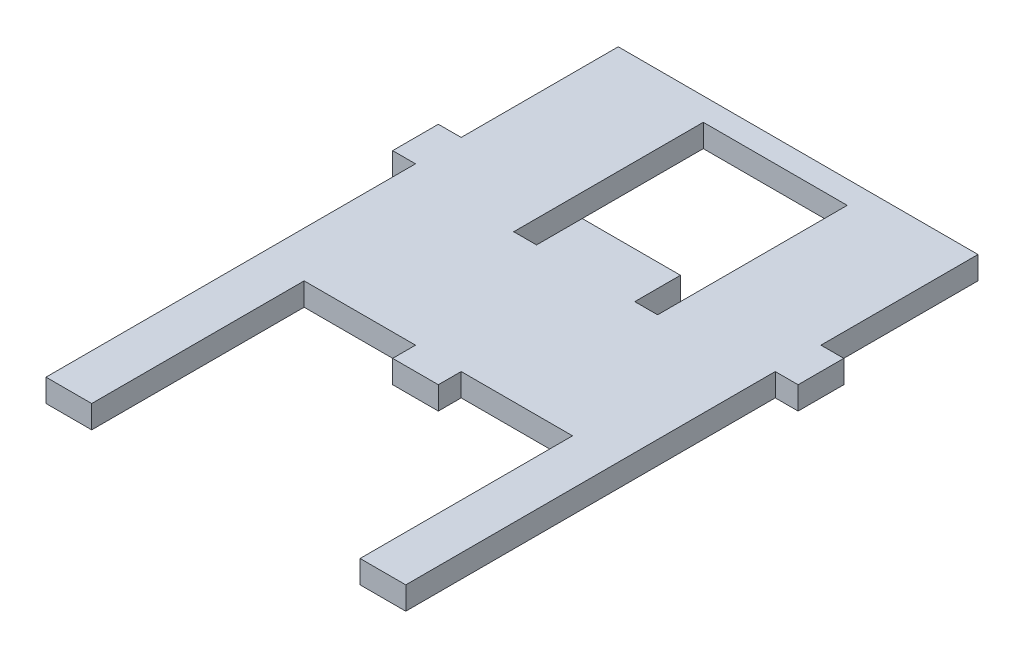
ISO-10303-21;
HEADER;
FILE_DESCRIPTION(('STEP AP214'),'2;1');
FILE_NAME('part.step','',(''),(''),'','','');
FILE_SCHEMA(('AUTOMOTIVE_DESIGN { 1 0 10303 214 1 1 1 1 }'));
ENDSEC;
DATA;
#1=APPLICATION_CONTEXT('core data for automotive mechanical design processes');
#2=APPLICATION_PROTOCOL_DEFINITION('international standard','automotive_design',2000,#1);
#3=PRODUCT_CONTEXT('',#1,'mechanical');
#4=PRODUCT('Part','Part','',(#3));
#5=PRODUCT_RELATED_PRODUCT_CATEGORY('part','',(#4));
#6=PRODUCT_DEFINITION_FORMATION('','',#4);
#7=PRODUCT_DEFINITION_CONTEXT('part definition',#1,'design');
#8=PRODUCT_DEFINITION('design','',#6,#7);
#9=PRODUCT_DEFINITION_SHAPE('','',#8);
#10=(LENGTH_UNIT() NAMED_UNIT(*) SI_UNIT(.MILLI.,.METRE.));
#11=(NAMED_UNIT(*) PLANE_ANGLE_UNIT() SI_UNIT($,.RADIAN.));
#12=(NAMED_UNIT(*) SI_UNIT($,.STERADIAN.) SOLID_ANGLE_UNIT());
#13=UNCERTAINTY_MEASURE_WITH_UNIT(LENGTH_MEASURE(1.E-05),#10,'distance_accuracy_value','');
#14=(GEOMETRIC_REPRESENTATION_CONTEXT(3) GLOBAL_UNCERTAINTY_ASSIGNED_CONTEXT((#13)) GLOBAL_UNIT_ASSIGNED_CONTEXT((#10,
#11,#12)) REPRESENTATION_CONTEXT('',''));
#15=CARTESIAN_POINT('',(0.,0.,0.));
#16=DIRECTION('',(0.,0.,1.));
#17=DIRECTION('',(1.,0.,0.));
#18=AXIS2_PLACEMENT_3D('',#15,#16,#17);
#19=CARTESIAN_POINT('',(0.,6.35,0.));
#20=DIRECTION('',(0.,-1.,0.));
#21=DIRECTION('',(0.,0.,-1.));
#22=AXIS2_PLACEMENT_3D('',#19,#20,#21);
#23=PLANE('',#22);
#24=DIRECTION('',(0.,0.,-1.));
#25=VECTOR('',#24,1.);
#26=CARTESIAN_POINT('',(50.,6.35,50.));
#27=LINE('',#26,#25);
#28=CARTESIAN_POINT('',(50.0000000000008,6.35,109.05));
#29=VERTEX_POINT('',#28);
#30=CARTESIAN_POINT('',(50.,6.35,6.35));
#31=VERTEX_POINT('',#30);
#32=EDGE_CURVE('E509',#29,#31,#27,.T.);
#33=ORIENTED_EDGE('',*,*,#32,.T.);
#34=DIRECTION('',(-1.,0.,0.));
#35=VECTOR('',#34,1.);
#36=CARTESIAN_POINT('',(56.35,6.35,6.35));
#37=LINE('',#36,#35);
#38=CARTESIAN_POINT('',(56.35,6.35,6.35));
#39=VERTEX_POINT('',#38);
#40=EDGE_CURVE('E328',#39,#31,#37,.T.);
#41=ORIENTED_EDGE('',*,*,#40,.F.);
#42=DIRECTION('',(0.,0.,-1.));
#43=VECTOR('',#42,1.);
#44=CARTESIAN_POINT('',(56.35,6.35,6.35));
#45=LINE('',#44,#43);
#46=CARTESIAN_POINT('',(56.35,6.35,-6.35));
#47=VERTEX_POINT('',#46);
#48=EDGE_CURVE('E302',#39,#47,#45,.T.);
#49=ORIENTED_EDGE('',*,*,#48,.T.);
#50=DIRECTION('',(-1.,0.,0.));
#51=VECTOR('',#50,1.);
#52=CARTESIAN_POINT('',(56.35,6.35,-6.35));
#53=LINE('',#52,#51);
#54=CARTESIAN_POINT('',(50.,6.35,-6.35));
#55=VERTEX_POINT('',#54);
#56=EDGE_CURVE('E323',#47,#55,#53,.T.);
#57=ORIENTED_EDGE('',*,*,#56,.T.);
#58=CARTESIAN_POINT('',(50.,6.35,-50.));
#59=VERTEX_POINT('',#58);
#60=EDGE_CURVE('E339',#55,#59,#27,.T.);
#61=ORIENTED_EDGE('',*,*,#60,.T.);
#62=DIRECTION('',(-1.,0.,0.));
#63=VECTOR('',#62,1.);
#64=CARTESIAN_POINT('',(-50.,6.35,-50.));
#65=LINE('',#64,#63);
#66=CARTESIAN_POINT('',(-50.,6.35,-50.));
#67=VERTEX_POINT('',#66);
#68=EDGE_CURVE('E441',#59,#67,#65,.T.);
#69=ORIENTED_EDGE('',*,*,#68,.T.);
#70=DIRECTION('',(0.,0.,1.));
#71=VECTOR('',#70,1.);
#72=CARTESIAN_POINT('',(-50.,6.35,50.));
#73=LINE('',#72,#71);
#74=CARTESIAN_POINT('',(-50.,6.35,-6.35));
#75=VERTEX_POINT('',#74);
#76=EDGE_CURVE('E360',#67,#75,#73,.T.);
#77=ORIENTED_EDGE('',*,*,#76,.T.);
#78=DIRECTION('',(1.,0.,0.));
#79=VECTOR('',#78,1.);
#80=CARTESIAN_POINT('',(-56.35,6.35,-6.35));
#81=LINE('',#80,#79);
#82=CARTESIAN_POINT('',(-56.35,6.35,-6.35));
#83=VERTEX_POINT('',#82);
#84=EDGE_CURVE('E429',#83,#75,#81,.T.);
#85=ORIENTED_EDGE('',*,*,#84,.F.);
#86=DIRECTION('',(0.,0.,1.));
#87=VECTOR('',#86,1.);
#88=CARTESIAN_POINT('',(-56.35,6.35,-6.35));
#89=LINE('',#88,#87);
#90=CARTESIAN_POINT('',(-56.35,6.35,6.35));
#91=VERTEX_POINT('',#90);
#92=EDGE_CURVE('E402',#83,#91,#89,.T.);
#93=ORIENTED_EDGE('',*,*,#92,.T.);
#94=DIRECTION('',(1.,0.,0.));
#95=VECTOR('',#94,1.);
#96=CARTESIAN_POINT('',(-56.35,6.35,6.35));
#97=LINE('',#96,#95);
#98=CARTESIAN_POINT('',(-50.,6.35,6.35));
#99=VERTEX_POINT('',#98);
#100=EDGE_CURVE('E424',#91,#99,#97,.T.);
#101=ORIENTED_EDGE('',*,*,#100,.T.);
#102=CARTESIAN_POINT('',(-50.,6.35,109.05));
#103=VERTEX_POINT('',#102);
#104=EDGE_CURVE('E439',#99,#103,#73,.T.);
#105=ORIENTED_EDGE('',*,*,#104,.T.);
#106=DIRECTION('',(-1.,0.,0.));
#107=VECTOR('',#106,1.);
#108=CARTESIAN_POINT('',(-50.,6.35,109.05));
#109=LINE('',#108,#107);
#110=CARTESIAN_POINT('',(-37.3,6.35,109.05));
#111=VERTEX_POINT('',#110);
#112=EDGE_CURVE('E284',#111,#103,#109,.T.);
#113=ORIENTED_EDGE('',*,*,#112,.F.);
#114=DIRECTION('',(0.,0.,-1.));
#115=VECTOR('',#114,1.);
#116=CARTESIAN_POINT('',(-37.3,6.35,109.05));
#117=LINE('',#116,#115);
#118=CARTESIAN_POINT('',(-37.3,6.35,50.));
#119=VERTEX_POINT('',#118);
#120=EDGE_CURVE('E287',#111,#119,#117,.T.);
#121=ORIENTED_EDGE('',*,*,#120,.T.);
#122=DIRECTION('',(1.,0.,0.));
#123=VECTOR('',#122,1.);
#124=CARTESIAN_POINT('',(-50.,6.35,50.));
#125=LINE('',#124,#123);
#126=CARTESIAN_POINT('',(-6.34999999999983,6.35,50.));
#127=VERTEX_POINT('',#126);
#128=EDGE_CURVE('E341',#119,#127,#125,.T.);
#129=ORIENTED_EDGE('',*,*,#128,.T.);
#130=DIRECTION('',(0.,0.,-1.));
#131=VECTOR('',#130,1.);
#132=CARTESIAN_POINT('',(-6.34999999999981,6.35,56.35));
#133=LINE('',#132,#131);
#134=CARTESIAN_POINT('',(-6.34999999999981,6.35,56.35));
#135=VERTEX_POINT('',#134);
#136=EDGE_CURVE('E380',#135,#127,#133,.T.);
#137=ORIENTED_EDGE('',*,*,#136,.F.);
#138=DIRECTION('',(1.,0.,0.));
#139=VECTOR('',#138,1.);
#140=CARTESIAN_POINT('',(-6.34999999999981,6.35,56.35));
#141=LINE('',#140,#139);
#142=CARTESIAN_POINT('',(6.35000000000019,6.35,56.35));
#143=VERTEX_POINT('',#142);
#144=EDGE_CURVE('E476',#135,#143,#141,.T.);
#145=ORIENTED_EDGE('',*,*,#144,.T.);
#146=DIRECTION('',(0.,0.,-1.));
#147=VECTOR('',#146,1.);
#148=CARTESIAN_POINT('',(6.35000000000019,6.35,56.35));
#149=LINE('',#148,#147);
#150=CARTESIAN_POINT('',(6.35000000000017,6.35,50.));
#151=VERTEX_POINT('',#150);
#152=EDGE_CURVE('E361',#143,#151,#149,.T.);
#153=ORIENTED_EDGE('',*,*,#152,.T.);
#154=CARTESIAN_POINT('',(37.3000000000004,6.35,50.));
#155=VERTEX_POINT('',#154);
#156=EDGE_CURVE('E358',#151,#155,#125,.T.);
#157=ORIENTED_EDGE('',*,*,#156,.T.);
#158=DIRECTION('',(0.,0.,-1.));
#159=VECTOR('',#158,1.);
#160=CARTESIAN_POINT('',(37.3000000000008,6.35,109.05));
#161=LINE('',#160,#159);
#162=CARTESIAN_POINT('',(37.3000000000008,6.35,109.05));
#163=VERTEX_POINT('',#162);
#164=EDGE_CURVE('E273',#163,#155,#161,.T.);
#165=ORIENTED_EDGE('',*,*,#164,.F.);
#166=DIRECTION('',(1.,0.,0.));
#167=VECTOR('',#166,1.);
#168=CARTESIAN_POINT('',(50.0000000000008,6.35,109.05));
#169=LINE('',#168,#167);
#170=EDGE_CURVE('E260',#163,#29,#169,.T.);
#171=ORIENTED_EDGE('',*,*,#170,.T.);
#172=EDGE_LOOP('',(#33,#41,#49,#57,#61,#69,#77,#85,#93,#101,#105,#113,#121,#129,#137,#145,#153,
#157,#165,#171));
#173=FACE_BOUND('',#172,.T.);
#174=DIRECTION('',(0.,0.,-1.));
#175=VECTOR('',#174,1.);
#176=CARTESIAN_POINT('',(20.,6.35,-3.64999999999999));
#177=LINE('',#176,#175);
#178=CARTESIAN_POINT('',(20.0000000000001,6.35,9.04999999999987));
#179=VERTEX_POINT('',#178);
#180=CARTESIAN_POINT('',(20.,6.35,-43.65));
#181=VERTEX_POINT('',#180);
#182=EDGE_CURVE('E242',#179,#181,#177,.T.);
#183=ORIENTED_EDGE('',*,*,#182,.F.);
#184=DIRECTION('',(-1.,0.,0.));
#185=VECTOR('',#184,1.);
#186=CARTESIAN_POINT('',(20.0000000000001,6.35,9.04999999999987));
#187=LINE('',#186,#185);
#188=CARTESIAN_POINT('',(13.6500000000001,6.35,9.04999999999991));
#189=VERTEX_POINT('',#188);
#190=EDGE_CURVE('E230',#179,#189,#187,.T.);
#191=ORIENTED_EDGE('',*,*,#190,.T.);
#192=DIRECTION('',(0.,0.,-1.));
#193=VECTOR('',#192,1.);
#194=CARTESIAN_POINT('',(13.65,6.35,-3.65000000000009));
#195=LINE('',#194,#193);
#196=CARTESIAN_POINT('',(13.65,6.35,-3.65000000000009));
#197=VERTEX_POINT('',#196);
#198=EDGE_CURVE('E222',#189,#197,#195,.T.);
#199=ORIENTED_EDGE('',*,*,#198,.T.);
#200=DIRECTION('',(1.,0.,0.));
#201=VECTOR('',#200,1.);
#202=CARTESIAN_POINT('',(-20.,6.35,-3.64999999999999));
#203=LINE('',#202,#201);
#204=CARTESIAN_POINT('',(-13.65,6.35,-3.64999999999999));
#205=VERTEX_POINT('',#204);
#206=EDGE_CURVE('E235',#205,#197,#203,.T.);
#207=ORIENTED_EDGE('',*,*,#206,.F.);
#208=DIRECTION('',(0.,0.,-1.));
#209=VECTOR('',#208,1.);
#210=CARTESIAN_POINT('',(-13.65,6.35,-3.64999999999999));
#211=LINE('',#210,#209);
#212=CARTESIAN_POINT('',(-13.65,6.35,9.05000000000001));
#213=VERTEX_POINT('',#212);
#214=EDGE_CURVE('E712',#213,#205,#211,.T.);
#215=ORIENTED_EDGE('',*,*,#214,.F.);
#216=DIRECTION('',(1.,0.,0.));
#217=VECTOR('',#216,1.);
#218=CARTESIAN_POINT('',(-20.,6.35,9.05000000000001));
#219=LINE('',#218,#217);
#220=CARTESIAN_POINT('',(-20.,6.35,9.05000000000001));
#221=VERTEX_POINT('',#220);
#222=EDGE_CURVE('E709',#221,#213,#219,.T.);
#223=ORIENTED_EDGE('',*,*,#222,.F.);
#224=DIRECTION('',(0.,0.,1.));
#225=VECTOR('',#224,1.);
#226=CARTESIAN_POINT('',(-20.,6.35,-3.64999999999999));
#227=LINE('',#226,#225);
#228=CARTESIAN_POINT('',(-20.,6.35,-43.65));
#229=VERTEX_POINT('',#228);
#230=EDGE_CURVE('E252',#229,#221,#227,.T.);
#231=ORIENTED_EDGE('',*,*,#230,.F.);
#232=DIRECTION('',(-1.,0.,0.));
#233=VECTOR('',#232,1.);
#234=CARTESIAN_POINT('',(-20.,6.35,-43.65));
#235=LINE('',#234,#233);
#236=EDGE_CURVE('E245',#181,#229,#235,.T.);
#237=ORIENTED_EDGE('',*,*,#236,.F.);
#238=EDGE_LOOP('',(#183,#191,#199,#207,#215,#223,#231,#237));
#239=FACE_BOUND('',#238,.T.);
#240=ADVANCED_FACE('F33',(#173,#239),#23,.F.);
#241=CARTESIAN_POINT('',(0.,0.,0.));
#242=DIRECTION('',(0.,-1.,0.));
#243=DIRECTION('',(0.,0.,-1.));
#244=AXIS2_PLACEMENT_3D('',#241,#242,#243);
#245=PLANE('',#244);
#246=DIRECTION('',(0.,0.,-1.));
#247=VECTOR('',#246,1.);
#248=CARTESIAN_POINT('',(50.,0.,50.));
#249=LINE('',#248,#247);
#250=CARTESIAN_POINT('',(50.0000000000008,0.,109.05));
#251=VERTEX_POINT('',#250);
#252=CARTESIAN_POINT('',(50.,0.,6.35));
#253=VERTEX_POINT('',#252);
#254=EDGE_CURVE('E376',#251,#253,#249,.T.);
#255=ORIENTED_EDGE('',*,*,#254,.F.);
#256=DIRECTION('',(-1.,0.,0.));
#257=VECTOR('',#256,1.);
#258=CARTESIAN_POINT('',(50.0000000000008,0.,109.05));
#259=LINE('',#258,#257);
#260=CARTESIAN_POINT('',(37.3000000000008,0.,109.05));
#261=VERTEX_POINT('',#260);
#262=EDGE_CURVE('E266',#251,#261,#259,.T.);
#263=ORIENTED_EDGE('',*,*,#262,.T.);
#264=DIRECTION('',(0.,0.,-1.));
#265=VECTOR('',#264,1.);
#266=CARTESIAN_POINT('',(37.3000000000008,0.,109.05));
#267=LINE('',#266,#265);
#268=CARTESIAN_POINT('',(37.3000000000004,0.,50.));
#269=VERTEX_POINT('',#268);
#270=EDGE_CURVE('E269',#261,#269,#267,.T.);
#271=ORIENTED_EDGE('',*,*,#270,.T.);
#272=DIRECTION('',(1.,0.,0.));
#273=VECTOR('',#272,1.);
#274=CARTESIAN_POINT('',(-50.,0.,50.));
#275=LINE('',#274,#273);
#276=CARTESIAN_POINT('',(6.35000000000017,0.,50.));
#277=VERTEX_POINT('',#276);
#278=EDGE_CURVE('E340',#277,#269,#275,.T.);
#279=ORIENTED_EDGE('',*,*,#278,.F.);
#280=DIRECTION('',(0.,0.,-1.));
#281=VECTOR('',#280,1.);
#282=CARTESIAN_POINT('',(6.35000000000019,0.,56.35));
#283=LINE('',#282,#281);
#284=CARTESIAN_POINT('',(6.35000000000019,0.,56.35));
#285=VERTEX_POINT('',#284);
#286=EDGE_CURVE('E418',#285,#277,#283,.T.);
#287=ORIENTED_EDGE('',*,*,#286,.F.);
#288=DIRECTION('',(1.,0.,0.));
#289=VECTOR('',#288,1.);
#290=CARTESIAN_POINT('',(-6.34999999999981,0.,56.35));
#291=LINE('',#290,#289);
#292=CARTESIAN_POINT('',(-6.34999999999981,0.,56.35));
#293=VERTEX_POINT('',#292);
#294=EDGE_CURVE('E388',#293,#285,#291,.T.);
#295=ORIENTED_EDGE('',*,*,#294,.F.);
#296=DIRECTION('',(0.,0.,-1.));
#297=VECTOR('',#296,1.);
#298=CARTESIAN_POINT('',(-6.34999999999981,0.,56.35));
#299=LINE('',#298,#297);
#300=CARTESIAN_POINT('',(-6.34999999999983,0.,50.));
#301=VERTEX_POINT('',#300);
#302=EDGE_CURVE('E383',#293,#301,#299,.T.);
#303=ORIENTED_EDGE('',*,*,#302,.T.);
#304=CARTESIAN_POINT('',(-37.3,0.,50.));
#305=VERTEX_POINT('',#304);
#306=EDGE_CURVE('E336',#305,#301,#275,.T.);
#307=ORIENTED_EDGE('',*,*,#306,.F.);
#308=DIRECTION('',(0.,0.,-1.));
#309=VECTOR('',#308,1.);
#310=CARTESIAN_POINT('',(-37.3,0.,109.05));
#311=LINE('',#310,#309);
#312=CARTESIAN_POINT('',(-37.3,0.,109.05));
#313=VERTEX_POINT('',#312);
#314=EDGE_CURVE('E292',#313,#305,#311,.T.);
#315=ORIENTED_EDGE('',*,*,#314,.F.);
#316=DIRECTION('',(1.,0.,0.));
#317=VECTOR('',#316,1.);
#318=CARTESIAN_POINT('',(-50.,0.,109.05));
#319=LINE('',#318,#317);
#320=CARTESIAN_POINT('',(-50.,0.,109.05));
#321=VERTEX_POINT('',#320);
#322=EDGE_CURVE('E280',#321,#313,#319,.T.);
#323=ORIENTED_EDGE('',*,*,#322,.F.);
#324=DIRECTION('',(0.,0.,1.));
#325=VECTOR('',#324,1.);
#326=CARTESIAN_POINT('',(-50.,0.,50.));
#327=LINE('',#326,#325);
#328=CARTESIAN_POINT('',(-50.,0.,6.34999999999999));
#329=VERTEX_POINT('',#328);
#330=EDGE_CURVE('E444',#329,#321,#327,.T.);
#331=ORIENTED_EDGE('',*,*,#330,.F.);
#332=DIRECTION('',(1.,0.,0.));
#333=VECTOR('',#332,1.);
#334=CARTESIAN_POINT('',(-56.35,0.,6.35));
#335=LINE('',#334,#333);
#336=CARTESIAN_POINT('',(-56.35,0.,6.35));
#337=VERTEX_POINT('',#336);
#338=EDGE_CURVE('E421',#337,#329,#335,.T.);
#339=ORIENTED_EDGE('',*,*,#338,.F.);
#340=DIRECTION('',(0.,0.,1.));
#341=VECTOR('',#340,1.);
#342=CARTESIAN_POINT('',(-56.35,0.,-6.35));
#343=LINE('',#342,#341);
#344=CARTESIAN_POINT('',(-56.35,0.,-6.35));
#345=VERTEX_POINT('',#344);
#346=EDGE_CURVE('E396',#345,#337,#343,.T.);
#347=ORIENTED_EDGE('',*,*,#346,.F.);
#348=DIRECTION('',(1.,0.,0.));
#349=VECTOR('',#348,1.);
#350=CARTESIAN_POINT('',(-56.35,0.,-6.35));
#351=LINE('',#350,#349);
#352=CARTESIAN_POINT('',(-50.,0.,-6.35));
#353=VERTEX_POINT('',#352);
#354=EDGE_CURVE('E408',#345,#353,#351,.T.);
#355=ORIENTED_EDGE('',*,*,#354,.T.);
#356=CARTESIAN_POINT('',(-50.,0.,-50.));
#357=VERTEX_POINT('',#356);
#358=EDGE_CURVE('E355',#357,#353,#327,.T.);
#359=ORIENTED_EDGE('',*,*,#358,.F.);
#360=DIRECTION('',(-1.,0.,0.));
#361=VECTOR('',#360,1.);
#362=CARTESIAN_POINT('',(-50.,0.,-50.));
#363=LINE('',#362,#361);
#364=CARTESIAN_POINT('',(50.,0.,-50.));
#365=VERTEX_POINT('',#364);
#366=EDGE_CURVE('E370',#365,#357,#363,.T.);
#367=ORIENTED_EDGE('',*,*,#366,.F.);
#368=CARTESIAN_POINT('',(50.,0.,-6.34999999999999));
#369=VERTEX_POINT('',#368);
#370=EDGE_CURVE('E373',#369,#365,#249,.T.);
#371=ORIENTED_EDGE('',*,*,#370,.F.);
#372=DIRECTION('',(-1.,0.,0.));
#373=VECTOR('',#372,1.);
#374=CARTESIAN_POINT('',(56.35,0.,-6.35));
#375=LINE('',#374,#373);
#376=CARTESIAN_POINT('',(56.35,0.,-6.35));
#377=VERTEX_POINT('',#376);
#378=EDGE_CURVE('E319',#377,#369,#375,.T.);
#379=ORIENTED_EDGE('',*,*,#378,.F.);
#380=DIRECTION('',(0.,0.,-1.));
#381=VECTOR('',#380,1.);
#382=CARTESIAN_POINT('',(56.35,0.,6.35));
#383=LINE('',#382,#381);
#384=CARTESIAN_POINT('',(56.35,0.,6.35));
#385=VERTEX_POINT('',#384);
#386=EDGE_CURVE('E296',#385,#377,#383,.T.);
#387=ORIENTED_EDGE('',*,*,#386,.F.);
#388=DIRECTION('',(-1.,0.,0.));
#389=VECTOR('',#388,1.);
#390=CARTESIAN_POINT('',(56.35,0.,6.35));
#391=LINE('',#390,#389);
#392=EDGE_CURVE('E308',#385,#253,#391,.T.);
#393=ORIENTED_EDGE('',*,*,#392,.T.);
#394=EDGE_LOOP('',(#255,#263,#271,#279,#287,#295,#303,#307,#315,#323,#331,#339,#347,#355,#359,
#367,#371,#379,#387,#393));
#395=FACE_BOUND('',#394,.T.);
#396=DIRECTION('',(1.,0.,0.));
#397=VECTOR('',#396,1.);
#398=CARTESIAN_POINT('',(0.,0.,9.05000000000001));
#399=LINE('',#398,#397);
#400=CARTESIAN_POINT('',(13.6500000000001,0.,9.04999999999991));
#401=VERTEX_POINT('',#400);
#402=CARTESIAN_POINT('',(20.0000000000001,0.,9.04999999999987));
#403=VERTEX_POINT('',#402);
#404=EDGE_CURVE('E11',#401,#403,#399,.T.);
#405=ORIENTED_EDGE('',*,*,#404,.T.);
#406=DIRECTION('',(0.,0.,1.));
#407=VECTOR('',#406,1.);
#408=CARTESIAN_POINT('',(20.,0.,0.));
#409=LINE('',#408,#407);
#410=CARTESIAN_POINT('',(20.,0.,-43.65));
#411=VERTEX_POINT('',#410);
#412=EDGE_CURVE('E448',#411,#403,#409,.T.);
#413=ORIENTED_EDGE('',*,*,#412,.F.);
#414=DIRECTION('',(1.,0.,0.));
#415=VECTOR('',#414,1.);
#416=CARTESIAN_POINT('',(0.,0.,-43.65));
#417=LINE('',#416,#415);
#418=CARTESIAN_POINT('',(-20.,0.,-43.65));
#419=VERTEX_POINT('',#418);
#420=EDGE_CURVE('E452',#419,#411,#417,.T.);
#421=ORIENTED_EDGE('',*,*,#420,.F.);
#422=DIRECTION('',(0.,0.,-1.));
#423=VECTOR('',#422,1.);
#424=CARTESIAN_POINT('',(-20.,0.,0.));
#425=LINE('',#424,#423);
#426=CARTESIAN_POINT('',(-20.,0.,9.05000000000001));
#427=VERTEX_POINT('',#426);
#428=EDGE_CURVE('E727',#427,#419,#425,.T.);
#429=ORIENTED_EDGE('',*,*,#428,.F.);
#430=DIRECTION('',(-1.,0.,0.));
#431=VECTOR('',#430,1.);
#432=CARTESIAN_POINT('',(0.,0.,9.05000000000001));
#433=LINE('',#432,#431);
#434=CARTESIAN_POINT('',(-13.65,0.,9.05000000000001));
#435=VERTEX_POINT('',#434);
#436=EDGE_CURVE('E41',#435,#427,#433,.T.);
#437=ORIENTED_EDGE('',*,*,#436,.F.);
#438=DIRECTION('',(0.,0.,1.));
#439=VECTOR('',#438,1.);
#440=CARTESIAN_POINT('',(-13.65,0.,0.));
#441=LINE('',#440,#439);
#442=CARTESIAN_POINT('',(-13.65,0.,-3.64999999999999));
#443=VERTEX_POINT('',#442);
#444=EDGE_CURVE('E243',#443,#435,#441,.T.);
#445=ORIENTED_EDGE('',*,*,#444,.F.);
#446=DIRECTION('',(-1.,0.,0.));
#447=VECTOR('',#446,1.);
#448=CARTESIAN_POINT('',(0.,0.,-3.64999999999999));
#449=LINE('',#448,#447);
#450=CARTESIAN_POINT('',(13.65,0.,-3.65000000000009));
#451=VERTEX_POINT('',#450);
#452=EDGE_CURVE('E728',#451,#443,#449,.T.);
#453=ORIENTED_EDGE('',*,*,#452,.F.);
#454=DIRECTION('',(0.,0.,1.));
#455=VECTOR('',#454,1.);
#456=CARTESIAN_POINT('',(13.65,0.,0.));
#457=LINE('',#456,#455);
#458=EDGE_CURVE('E225',#451,#401,#457,.T.);
#459=ORIENTED_EDGE('',*,*,#458,.T.);
#460=EDGE_LOOP('',(#405,#413,#421,#429,#437,#445,#453,#459));
#461=FACE_BOUND('',#460,.T.);
#462=ADVANCED_FACE('F486',(#395,#461),#245,.T.);
#463=CARTESIAN_POINT('',(-20.,-4.99999999997031E-05,-3.64999999999999));
#464=DIRECTION('',(0.,0.,1.));
#465=DIRECTION('',(1.,0.,0.));
#466=AXIS2_PLACEMENT_3D('',#463,#464,#465);
#467=PLANE('',#466);
#468=DIRECTION('',(0.,1.,0.));
#469=VECTOR('',#468,1.);
#470=CARTESIAN_POINT('',(13.65,-4.99999999997031E-05,-3.65000000000009));
#471=LINE('',#470,#469);
#472=EDGE_CURVE('E218',#451,#197,#471,.T.);
#473=ORIENTED_EDGE('',*,*,#472,.F.);
#474=ORIENTED_EDGE('',*,*,#452,.T.);
#475=DIRECTION('',(0.,1.,0.));
#476=VECTOR('',#475,1.);
#477=CARTESIAN_POINT('',(-13.65,-4.99999999997031E-05,-3.64999999999999));
#478=LINE('',#477,#476);
#479=EDGE_CURVE('E241',#443,#205,#478,.T.);
#480=ORIENTED_EDGE('',*,*,#479,.T.);
#481=ORIENTED_EDGE('',*,*,#206,.T.);
#482=EDGE_LOOP('',(#473,#474,#480,#481));
#483=FACE_BOUND('',#482,.T.);
#484=ADVANCED_FACE('F239',(#483),#467,.F.);
#485=CARTESIAN_POINT('',(-50.,6.35,50.));
#486=DIRECTION('',(0.,0.,-1.));
#487=DIRECTION('',(-1.,0.,0.));
#488=AXIS2_PLACEMENT_3D('',#485,#486,#487);
#489=PLANE('',#488);
#490=DIRECTION('',(0.,1.,0.));
#491=VECTOR('',#490,1.);
#492=CARTESIAN_POINT('',(-37.3,6.35,50.));
#493=LINE('',#492,#491);
#494=EDGE_CURVE('E276',#305,#119,#493,.T.);
#495=ORIENTED_EDGE('',*,*,#494,.F.);
#496=ORIENTED_EDGE('',*,*,#306,.T.);
#497=DIRECTION('',(0.,1.,0.));
#498=VECTOR('',#497,1.);
#499=CARTESIAN_POINT('',(-6.34999999999983,0.,50.));
#500=LINE('',#499,#498);
#501=EDGE_CURVE('E384',#301,#127,#500,.T.);
#502=ORIENTED_EDGE('',*,*,#501,.T.);
#503=ORIENTED_EDGE('',*,*,#128,.F.);
#504=EDGE_LOOP('',(#495,#496,#502,#503));
#505=FACE_BOUND('',#504,.T.);
#506=ADVANCED_FACE('F466',(#505),#489,.F.);
#507=CARTESIAN_POINT('',(50.,6.35,50.));
#508=DIRECTION('',(-1.,0.,0.));
#509=DIRECTION('',(0.,0.,1.));
#510=AXIS2_PLACEMENT_3D('',#507,#508,#509);
#511=PLANE('',#510);
#512=DIRECTION('',(0.,1.,0.));
#513=VECTOR('',#512,1.);
#514=CARTESIAN_POINT('',(50.,0.,-6.35));
#515=LINE('',#514,#513);
#516=EDGE_CURVE('E295',#369,#55,#515,.T.);
#517=ORIENTED_EDGE('',*,*,#516,.F.);
#518=ORIENTED_EDGE('',*,*,#370,.T.);
#519=DIRECTION('',(0.,-1.,0.));
#520=VECTOR('',#519,1.);
#521=CARTESIAN_POINT('',(50.,6.35,-50.));
#522=LINE('',#521,#520);
#523=EDGE_CURVE('E446',#59,#365,#522,.T.);
#524=ORIENTED_EDGE('',*,*,#523,.F.);
#525=ORIENTED_EDGE('',*,*,#60,.F.);
#526=EDGE_LOOP('',(#517,#518,#524,#525));
#527=FACE_BOUND('',#526,.T.);
#528=ADVANCED_FACE('F523',(#527),#511,.F.);
#529=ORIENTED_EDGE('',*,*,#278,.T.);
#530=DIRECTION('',(0.,1.,0.));
#531=VECTOR('',#530,1.);
#532=CARTESIAN_POINT('',(37.3000000000004,6.35,49.9999999999998));
#533=LINE('',#532,#531);
#534=EDGE_CURVE('E56',#269,#155,#533,.T.);
#535=ORIENTED_EDGE('',*,*,#534,.T.);
#536=ORIENTED_EDGE('',*,*,#156,.F.);
#537=DIRECTION('',(0.,1.,0.));
#538=VECTOR('',#537,1.);
#539=CARTESIAN_POINT('',(6.35000000000017,0.,50.));
#540=LINE('',#539,#538);
#541=EDGE_CURVE('E322',#277,#151,#540,.T.);
#542=ORIENTED_EDGE('',*,*,#541,.F.);
#543=EDGE_LOOP('',(#529,#535,#536,#542));
#544=FACE_BOUND('',#543,.T.);
#545=ADVANCED_FACE('F497',(#544),#489,.F.);
#546=CARTESIAN_POINT('',(-50.,6.35,50.));
#547=DIRECTION('',(1.,0.,0.));
#548=DIRECTION('',(0.,0.,-1.));
#549=AXIS2_PLACEMENT_3D('',#546,#547,#548);
#550=PLANE('',#549);
#551=DIRECTION('',(0.,1.,0.));
#552=VECTOR('',#551,1.);
#553=CARTESIAN_POINT('',(-50.,0.,6.35));
#554=LINE('',#553,#552);
#555=EDGE_CURVE('E414',#329,#99,#554,.T.);
#556=ORIENTED_EDGE('',*,*,#555,.F.);
#557=ORIENTED_EDGE('',*,*,#330,.T.);
#558=DIRECTION('',(0.,-1.,0.));
#559=VECTOR('',#558,1.);
#560=CARTESIAN_POINT('',(-50.,6.35,109.05));
#561=LINE('',#560,#559);
#562=EDGE_CURVE('E277',#103,#321,#561,.T.);
#563=ORIENTED_EDGE('',*,*,#562,.F.);
#564=ORIENTED_EDGE('',*,*,#104,.F.);
#565=EDGE_LOOP('',(#556,#557,#563,#564));
#566=FACE_BOUND('',#565,.T.);
#567=ADVANCED_FACE('F542',(#566),#550,.F.);
#568=ORIENTED_EDGE('',*,*,#254,.T.);
#569=DIRECTION('',(0.,1.,0.));
#570=VECTOR('',#569,1.);
#571=CARTESIAN_POINT('',(50.,0.,6.35));
#572=LINE('',#571,#570);
#573=EDGE_CURVE('E300',#253,#31,#572,.T.);
#574=ORIENTED_EDGE('',*,*,#573,.T.);
#575=ORIENTED_EDGE('',*,*,#32,.F.);
#576=DIRECTION('',(0.,-1.,0.));
#577=VECTOR('',#576,1.);
#578=CARTESIAN_POINT('',(50.0000000000008,6.35,109.05));
#579=LINE('',#578,#577);
#580=EDGE_CURVE('E257',#29,#251,#579,.T.);
#581=ORIENTED_EDGE('',*,*,#580,.T.);
#582=EDGE_LOOP('',(#568,#574,#575,#581));
#583=FACE_BOUND('',#582,.T.);
#584=ADVANCED_FACE('F35',(#583),#511,.F.);
#585=CARTESIAN_POINT('',(-50.,6.35,-50.));
#586=DIRECTION('',(0.,0.,1.));
#587=DIRECTION('',(1.,0.,0.));
#588=AXIS2_PLACEMENT_3D('',#585,#586,#587);
#589=PLANE('',#588);
#590=ORIENTED_EDGE('',*,*,#366,.T.);
#591=DIRECTION('',(0.,-1.,0.));
#592=VECTOR('',#591,1.);
#593=CARTESIAN_POINT('',(-50.,6.35,-50.));
#594=LINE('',#593,#592);
#595=EDGE_CURVE('E349',#67,#357,#594,.T.);
#596=ORIENTED_EDGE('',*,*,#595,.F.);
#597=ORIENTED_EDGE('',*,*,#68,.F.);
#598=ORIENTED_EDGE('',*,*,#523,.T.);
#599=EDGE_LOOP('',(#590,#596,#597,#598));
#600=FACE_BOUND('',#599,.T.);
#601=ADVANCED_FACE('F525',(#600),#589,.F.);
#602=ORIENTED_EDGE('',*,*,#358,.T.);
#603=DIRECTION('',(0.,1.,0.));
#604=VECTOR('',#603,1.);
#605=CARTESIAN_POINT('',(-50.,0.,-6.35));
#606=LINE('',#605,#604);
#607=EDGE_CURVE('E400',#353,#75,#606,.T.);
#608=ORIENTED_EDGE('',*,*,#607,.T.);
#609=ORIENTED_EDGE('',*,*,#76,.F.);
#610=ORIENTED_EDGE('',*,*,#595,.T.);
#611=EDGE_LOOP('',(#602,#608,#609,#610));
#612=FACE_BOUND('',#611,.T.);
#613=ADVANCED_FACE('F526',(#612),#550,.F.);
#614=CARTESIAN_POINT('',(-56.35,0.,6.35));
#615=DIRECTION('',(0.,0.,-1.));
#616=DIRECTION('',(-1.,0.,0.));
#617=AXIS2_PLACEMENT_3D('',#614,#615,#616);
#618=PLANE('',#617);
#619=ORIENTED_EDGE('',*,*,#555,.T.);
#620=ORIENTED_EDGE('',*,*,#100,.F.);
#621=DIRECTION('',(0.,1.,0.));
#622=VECTOR('',#621,1.);
#623=CARTESIAN_POINT('',(-56.35,0.,6.35));
#624=LINE('',#623,#622);
#625=EDGE_CURVE('E399',#337,#91,#624,.T.);
#626=ORIENTED_EDGE('',*,*,#625,.F.);
#627=ORIENTED_EDGE('',*,*,#338,.T.);
#628=EDGE_LOOP('',(#619,#620,#626,#627));
#629=FACE_BOUND('',#628,.T.);
#630=ADVANCED_FACE('F540',(#629),#618,.F.);
#631=CARTESIAN_POINT('',(-56.35,0.,-6.35));
#632=DIRECTION('',(0.,0.,-1.));
#633=DIRECTION('',(-1.,0.,0.));
#634=AXIS2_PLACEMENT_3D('',#631,#632,#633);
#635=PLANE('',#634);
#636=ORIENTED_EDGE('',*,*,#607,.F.);
#637=ORIENTED_EDGE('',*,*,#354,.F.);
#638=DIRECTION('',(0.,1.,0.));
#639=VECTOR('',#638,1.);
#640=CARTESIAN_POINT('',(-56.35,0.,-6.35));
#641=LINE('',#640,#639);
#642=EDGE_CURVE('E405',#345,#83,#641,.T.);
#643=ORIENTED_EDGE('',*,*,#642,.T.);
#644=ORIENTED_EDGE('',*,*,#84,.T.);
#645=EDGE_LOOP('',(#636,#637,#643,#644));
#646=FACE_BOUND('',#645,.T.);
#647=ADVANCED_FACE('F534',(#646),#635,.T.);
#648=CARTESIAN_POINT('',(-56.35,0.,0.));
#649=DIRECTION('',(-1.,0.,0.));
#650=DIRECTION('',(0.,0.,1.));
#651=AXIS2_PLACEMENT_3D('',#648,#649,#650);
#652=PLANE('',#651);
#653=ORIENTED_EDGE('',*,*,#346,.T.);
#654=ORIENTED_EDGE('',*,*,#625,.T.);
#655=ORIENTED_EDGE('',*,*,#92,.F.);
#656=ORIENTED_EDGE('',*,*,#642,.F.);
#657=EDGE_LOOP('',(#653,#654,#655,#656));
#658=FACE_BOUND('',#657,.T.);
#659=ADVANCED_FACE('F533',(#658),#652,.T.);
#660=CARTESIAN_POINT('',(6.35000000000019,0.,56.35));
#661=DIRECTION('',(-1.,0.,0.));
#662=DIRECTION('',(0.,0.,1.));
#663=AXIS2_PLACEMENT_3D('',#660,#661,#662);
#664=PLANE('',#663);
#665=ORIENTED_EDGE('',*,*,#541,.T.);
#666=ORIENTED_EDGE('',*,*,#152,.F.);
#667=DIRECTION('',(0.,1.,0.));
#668=VECTOR('',#667,1.);
#669=CARTESIAN_POINT('',(6.35000000000019,0.,56.35));
#670=LINE('',#669,#668);
#671=EDGE_CURVE('E477',#285,#143,#670,.T.);
#672=ORIENTED_EDGE('',*,*,#671,.F.);
#673=ORIENTED_EDGE('',*,*,#286,.T.);
#674=EDGE_LOOP('',(#665,#666,#672,#673));
#675=FACE_BOUND('',#674,.T.);
#676=ADVANCED_FACE('F496',(#675),#664,.F.);
#677=CARTESIAN_POINT('',(-6.34999999999981,0.,56.35));
#678=DIRECTION('',(-1.,0.,0.));
#679=DIRECTION('',(0.,0.,1.));
#680=AXIS2_PLACEMENT_3D('',#677,#678,#679);
#681=PLANE('',#680);
#682=ORIENTED_EDGE('',*,*,#501,.F.);
#683=ORIENTED_EDGE('',*,*,#302,.F.);
#684=DIRECTION('',(0.,1.,0.));
#685=VECTOR('',#684,1.);
#686=CARTESIAN_POINT('',(-6.34999999999981,0.,56.35));
#687=LINE('',#686,#685);
#688=EDGE_CURVE('E472',#293,#135,#687,.T.);
#689=ORIENTED_EDGE('',*,*,#688,.T.);
#690=ORIENTED_EDGE('',*,*,#136,.T.);
#691=EDGE_LOOP('',(#682,#683,#689,#690));
#692=FACE_BOUND('',#691,.T.);
#693=ADVANCED_FACE('F470',(#692),#681,.T.);
#694=CARTESIAN_POINT('',(1.96744973443811E-13,0.,56.35));
#695=DIRECTION('',(0.,0.,1.));
#696=DIRECTION('',(1.,0.,0.));
#697=AXIS2_PLACEMENT_3D('',#694,#695,#696);
#698=PLANE('',#697);
#699=ORIENTED_EDGE('',*,*,#294,.T.);
#700=ORIENTED_EDGE('',*,*,#671,.T.);
#701=ORIENTED_EDGE('',*,*,#144,.F.);
#702=ORIENTED_EDGE('',*,*,#688,.F.);
#703=EDGE_LOOP('',(#699,#700,#701,#702));
#704=FACE_BOUND('',#703,.T.);
#705=ADVANCED_FACE('F481',(#704),#698,.T.);
#706=CARTESIAN_POINT('',(56.35,0.,-6.35));
#707=DIRECTION('',(0.,0.,1.));
#708=DIRECTION('',(1.,0.,0.));
#709=AXIS2_PLACEMENT_3D('',#706,#707,#708);
#710=PLANE('',#709);
#711=ORIENTED_EDGE('',*,*,#516,.T.);
#712=ORIENTED_EDGE('',*,*,#56,.F.);
#713=DIRECTION('',(0.,1.,0.));
#714=VECTOR('',#713,1.);
#715=CARTESIAN_POINT('',(56.35,0.,-6.35));
#716=LINE('',#715,#714);
#717=EDGE_CURVE('E299',#377,#47,#716,.T.);
#718=ORIENTED_EDGE('',*,*,#717,.F.);
#719=ORIENTED_EDGE('',*,*,#378,.T.);
#720=EDGE_LOOP('',(#711,#712,#718,#719));
#721=FACE_BOUND('',#720,.T.);
#722=ADVANCED_FACE('F520',(#721),#710,.F.);
#723=CARTESIAN_POINT('',(56.35,0.,6.35));
#724=DIRECTION('',(0.,0.,1.));
#725=DIRECTION('',(1.,0.,0.));
#726=AXIS2_PLACEMENT_3D('',#723,#724,#725);
#727=PLANE('',#726);
#728=ORIENTED_EDGE('',*,*,#573,.F.);
#729=ORIENTED_EDGE('',*,*,#392,.F.);
#730=DIRECTION('',(0.,1.,0.));
#731=VECTOR('',#730,1.);
#732=CARTESIAN_POINT('',(56.35,0.,6.35));
#733=LINE('',#732,#731);
#734=EDGE_CURVE('E305',#385,#39,#733,.T.);
#735=ORIENTED_EDGE('',*,*,#734,.T.);
#736=ORIENTED_EDGE('',*,*,#40,.T.);
#737=EDGE_LOOP('',(#728,#729,#735,#736));
#738=FACE_BOUND('',#737,.T.);
#739=ADVANCED_FACE('F512',(#738),#727,.T.);
#740=CARTESIAN_POINT('',(56.35,0.,0.));
#741=DIRECTION('',(1.,0.,0.));
#742=DIRECTION('',(0.,0.,-1.));
#743=AXIS2_PLACEMENT_3D('',#740,#741,#742);
#744=PLANE('',#743);
#745=ORIENTED_EDGE('',*,*,#386,.T.);
#746=ORIENTED_EDGE('',*,*,#717,.T.);
#747=ORIENTED_EDGE('',*,*,#48,.F.);
#748=ORIENTED_EDGE('',*,*,#734,.F.);
#749=EDGE_LOOP('',(#745,#746,#747,#748));
#750=FACE_BOUND('',#749,.T.);
#751=ADVANCED_FACE('F515',(#750),#744,.T.);
#752=CARTESIAN_POINT('',(-37.3,6.35,109.05));
#753=DIRECTION('',(-1.,0.,0.));
#754=DIRECTION('',(0.,0.,1.));
#755=AXIS2_PLACEMENT_3D('',#752,#753,#754);
#756=PLANE('',#755);
#757=ORIENTED_EDGE('',*,*,#494,.T.);
#758=ORIENTED_EDGE('',*,*,#120,.F.);
#759=DIRECTION('',(0.,1.,0.));
#760=VECTOR('',#759,1.);
#761=CARTESIAN_POINT('',(-37.3,6.35,109.05));
#762=LINE('',#761,#760);
#763=EDGE_CURVE('E282',#313,#111,#762,.T.);
#764=ORIENTED_EDGE('',*,*,#763,.F.);
#765=ORIENTED_EDGE('',*,*,#314,.T.);
#766=EDGE_LOOP('',(#757,#758,#764,#765));
#767=FACE_BOUND('',#766,.T.);
#768=ADVANCED_FACE('F549',(#767),#756,.F.);
#769=CARTESIAN_POINT('',(0.,0.,109.05));
#770=DIRECTION('',(0.,0.,1.));
#771=DIRECTION('',(1.,0.,0.));
#772=AXIS2_PLACEMENT_3D('',#769,#770,#771);
#773=PLANE('',#772);
#774=ORIENTED_EDGE('',*,*,#562,.T.);
#775=ORIENTED_EDGE('',*,*,#322,.T.);
#776=ORIENTED_EDGE('',*,*,#763,.T.);
#777=ORIENTED_EDGE('',*,*,#112,.T.);
#778=EDGE_LOOP('',(#774,#775,#776,#777));
#779=FACE_BOUND('',#778,.T.);
#780=ADVANCED_FACE('F545',(#779),#773,.T.);
#781=CARTESIAN_POINT('',(37.3000000000008,6.35,109.05));
#782=DIRECTION('',(-1.,0.,0.));
#783=DIRECTION('',(0.,0.,1.));
#784=AXIS2_PLACEMENT_3D('',#781,#782,#783);
#785=PLANE('',#784);
#786=ORIENTED_EDGE('',*,*,#534,.F.);
#787=ORIENTED_EDGE('',*,*,#270,.F.);
#788=DIRECTION('',(0.,1.,0.));
#789=VECTOR('',#788,1.);
#790=CARTESIAN_POINT('',(37.3000000000008,6.35,109.05));
#791=LINE('',#790,#789);
#792=EDGE_CURVE('E263',#261,#163,#791,.T.);
#793=ORIENTED_EDGE('',*,*,#792,.T.);
#794=ORIENTED_EDGE('',*,*,#164,.T.);
#795=EDGE_LOOP('',(#786,#787,#793,#794));
#796=FACE_BOUND('',#795,.T.);
#797=ADVANCED_FACE('F500',(#796),#785,.T.);
#798=CARTESIAN_POINT('',(7.51986464815983E-13,0.,109.05));
#799=DIRECTION('',(0.,0.,1.));
#800=DIRECTION('',(-1.,0.,0.));
#801=AXIS2_PLACEMENT_3D('',#798,#799,#800);
#802=PLANE('',#801);
#803=ORIENTED_EDGE('',*,*,#580,.F.);
#804=ORIENTED_EDGE('',*,*,#170,.F.);
#805=ORIENTED_EDGE('',*,*,#792,.F.);
#806=ORIENTED_EDGE('',*,*,#262,.F.);
#807=EDGE_LOOP('',(#803,#804,#805,#806));
#808=FACE_BOUND('',#807,.T.);
#809=ADVANCED_FACE('F505',(#808),#802,.T.);
#810=CARTESIAN_POINT('',(-20.,-4.99999999997031E-05,-3.64999999999999));
#811=DIRECTION('',(-1.,0.,0.));
#812=DIRECTION('',(0.,0.,1.));
#813=AXIS2_PLACEMENT_3D('',#810,#811,#812);
#814=PLANE('',#813);
#815=ORIENTED_EDGE('',*,*,#428,.T.);
#816=DIRECTION('',(0.,1.,0.));
#817=VECTOR('',#816,1.);
#818=CARTESIAN_POINT('',(-20.,-4.99999999997031E-05,-43.65));
#819=LINE('',#818,#817);
#820=EDGE_CURVE('E254',#419,#229,#819,.T.);
#821=ORIENTED_EDGE('',*,*,#820,.T.);
#822=ORIENTED_EDGE('',*,*,#230,.T.);
#823=DIRECTION('',(0.,1.,0.));
#824=VECTOR('',#823,1.);
#825=CARTESIAN_POINT('',(-20.,-4.99999999997031E-05,9.05000000000001));
#826=LINE('',#825,#824);
#827=EDGE_CURVE('E714',#427,#221,#826,.T.);
#828=ORIENTED_EDGE('',*,*,#827,.F.);
#829=EDGE_LOOP('',(#815,#821,#822,#828));
#830=FACE_BOUND('',#829,.T.);
#831=ADVANCED_FACE('F607',(#830),#814,.F.);
#832=CARTESIAN_POINT('',(-20.,-4.99999999997031E-05,-43.65));
#833=DIRECTION('',(0.,0.,-1.));
#834=DIRECTION('',(-1.,0.,0.));
#835=AXIS2_PLACEMENT_3D('',#832,#833,#834);
#836=PLANE('',#835);
#837=ORIENTED_EDGE('',*,*,#420,.T.);
#838=DIRECTION('',(0.,1.,0.));
#839=VECTOR('',#838,1.);
#840=CARTESIAN_POINT('',(20.,-4.99999999997031E-05,-43.65));
#841=LINE('',#840,#839);
#842=EDGE_CURVE('E48',#411,#181,#841,.T.);
#843=ORIENTED_EDGE('',*,*,#842,.T.);
#844=ORIENTED_EDGE('',*,*,#236,.T.);
#845=ORIENTED_EDGE('',*,*,#820,.F.);
#846=EDGE_LOOP('',(#837,#843,#844,#845));
#847=FACE_BOUND('',#846,.T.);
#848=ADVANCED_FACE('F614',(#847),#836,.F.);
#849=CARTESIAN_POINT('',(20.,-4.99999999997031E-05,-3.64999999999999));
#850=DIRECTION('',(1.,0.,0.));
#851=DIRECTION('',(0.,0.,-1.));
#852=AXIS2_PLACEMENT_3D('',#849,#850,#851);
#853=PLANE('',#852);
#854=ORIENTED_EDGE('',*,*,#412,.T.);
#855=DIRECTION('',(0.,1.,0.));
#856=VECTOR('',#855,1.);
#857=CARTESIAN_POINT('',(20.0000000000001,-4.99999999997031E-05,9.04999999999987));
#858=LINE('',#857,#856);
#859=EDGE_CURVE('E702',#403,#179,#858,.T.);
#860=ORIENTED_EDGE('',*,*,#859,.T.);
#861=ORIENTED_EDGE('',*,*,#182,.T.);
#862=ORIENTED_EDGE('',*,*,#842,.F.);
#863=EDGE_LOOP('',(#854,#860,#861,#862));
#864=FACE_BOUND('',#863,.T.);
#865=ADVANCED_FACE('F619',(#864),#853,.F.);
#866=CARTESIAN_POINT('',(-13.65,-4.99999999997031E-05,-3.64999999999999));
#867=DIRECTION('',(1.,0.,0.));
#868=DIRECTION('',(0.,0.,-1.));
#869=AXIS2_PLACEMENT_3D('',#866,#867,#868);
#870=PLANE('',#869);
#871=ORIENTED_EDGE('',*,*,#444,.T.);
#872=DIRECTION('',(0.,1.,0.));
#873=VECTOR('',#872,1.);
#874=CARTESIAN_POINT('',(-13.65,-4.99999999997031E-05,9.05000000000001));
#875=LINE('',#874,#873);
#876=EDGE_CURVE('E716',#435,#213,#875,.T.);
#877=ORIENTED_EDGE('',*,*,#876,.T.);
#878=ORIENTED_EDGE('',*,*,#214,.T.);
#879=ORIENTED_EDGE('',*,*,#479,.F.);
#880=EDGE_LOOP('',(#871,#877,#878,#879));
#881=FACE_BOUND('',#880,.T.);
#882=ADVANCED_FACE('F636',(#881),#870,.F.);
#883=CARTESIAN_POINT('',(-20.,-4.99999999997031E-05,9.05000000000001));
#884=DIRECTION('',(0.,0.,1.));
#885=DIRECTION('',(1.,0.,0.));
#886=AXIS2_PLACEMENT_3D('',#883,#884,#885);
#887=PLANE('',#886);
#888=ORIENTED_EDGE('',*,*,#436,.T.);
#889=ORIENTED_EDGE('',*,*,#827,.T.);
#890=ORIENTED_EDGE('',*,*,#222,.T.);
#891=ORIENTED_EDGE('',*,*,#876,.F.);
#892=EDGE_LOOP('',(#888,#889,#890,#891));
#893=FACE_BOUND('',#892,.T.);
#894=ADVANCED_FACE('F640',(#893),#887,.F.);
#895=CARTESIAN_POINT('',(20.0000000000001,-4.99999999997031E-05,9.04999999999987));
#896=DIRECTION('',(0.,0.,-1.));
#897=DIRECTION('',(-1.,0.,0.));
#898=AXIS2_PLACEMENT_3D('',#895,#896,#897);
#899=PLANE('',#898);
#900=DIRECTION('',(0.,1.,0.));
#901=VECTOR('',#900,1.);
#902=CARTESIAN_POINT('',(13.6500000000001,-4.99999999997031E-05,9.04999999999991));
#903=LINE('',#902,#901);
#904=EDGE_CURVE('E229',#401,#189,#903,.T.);
#905=ORIENTED_EDGE('',*,*,#904,.T.);
#906=ORIENTED_EDGE('',*,*,#190,.F.);
#907=ORIENTED_EDGE('',*,*,#859,.F.);
#908=ORIENTED_EDGE('',*,*,#404,.F.);
#909=EDGE_LOOP('',(#905,#906,#907,#908));
#910=FACE_BOUND('',#909,.T.);
#911=ADVANCED_FACE('F649',(#910),#899,.T.);
#912=CARTESIAN_POINT('',(13.65,-4.99999999997031E-05,-3.65000000000009));
#913=DIRECTION('',(1.,0.,0.));
#914=DIRECTION('',(0.,0.,-1.));
#915=AXIS2_PLACEMENT_3D('',#912,#913,#914);
#916=PLANE('',#915);
#917=ORIENTED_EDGE('',*,*,#472,.T.);
#918=ORIENTED_EDGE('',*,*,#198,.F.);
#919=ORIENTED_EDGE('',*,*,#904,.F.);
#920=ORIENTED_EDGE('',*,*,#458,.F.);
#921=EDGE_LOOP('',(#917,#918,#919,#920));
#922=FACE_BOUND('',#921,.T.);
#923=ADVANCED_FACE('F220',(#922),#916,.T.);
#924=CLOSED_SHELL('',(#240,#462,#484,#506,#528,#545,#567,#584,#601,#613,#630,#647,#659,#676,
#693,#705,#722,#739,#751,#768,#780,#797,#809,#831,#848,#865,#882,#894,#911,#923));
#925=MANIFOLD_SOLID_BREP('B2',#924);
#926=ADVANCED_BREP_SHAPE_REPRESENTATION('',(#18,#925),#14);
#927=SHAPE_DEFINITION_REPRESENTATION(#9,#926);
ENDSEC;
END-ISO-10303-21;
